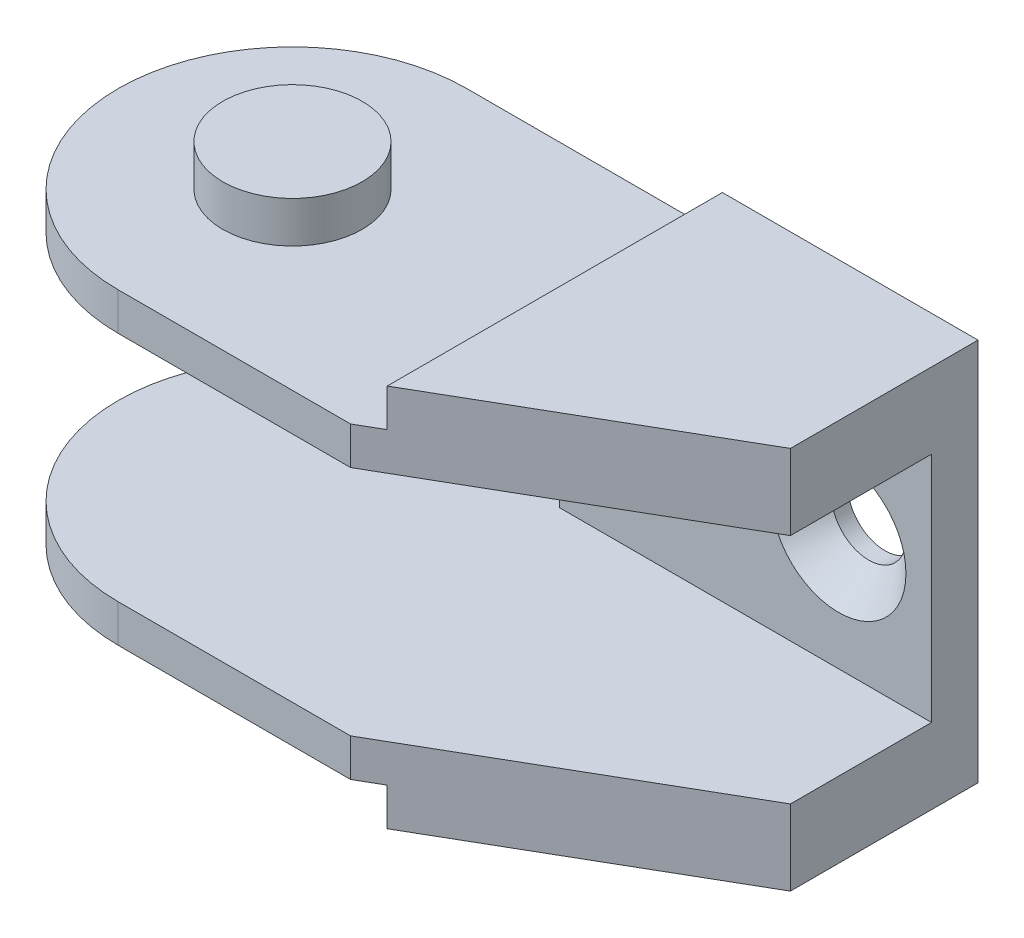
ISO-10303-21;
HEADER;
FILE_DESCRIPTION(('STEP AP214'),'2;1');
FILE_NAME('part.step','',(''),(''),'','','');
FILE_SCHEMA(('AUTOMOTIVE_DESIGN { 1 0 10303 214 1 1 1 1 }'));
ENDSEC;
DATA;
#1=APPLICATION_CONTEXT('core data for automotive mechanical design processes');
#2=APPLICATION_PROTOCOL_DEFINITION('international standard','automotive_design',2000,#1);
#3=PRODUCT_CONTEXT('',#1,'mechanical');
#4=PRODUCT('Part','Part','',(#3));
#5=PRODUCT_RELATED_PRODUCT_CATEGORY('part','',(#4));
#6=PRODUCT_DEFINITION_FORMATION('','',#4);
#7=PRODUCT_DEFINITION_CONTEXT('part definition',#1,'design');
#8=PRODUCT_DEFINITION('design','',#6,#7);
#9=PRODUCT_DEFINITION_SHAPE('','',#8);
#10=(LENGTH_UNIT() NAMED_UNIT(*) SI_UNIT(.MILLI.,.METRE.));
#11=(NAMED_UNIT(*) PLANE_ANGLE_UNIT() SI_UNIT($,.RADIAN.));
#12=(NAMED_UNIT(*) SI_UNIT($,.STERADIAN.) SOLID_ANGLE_UNIT());
#13=UNCERTAINTY_MEASURE_WITH_UNIT(LENGTH_MEASURE(1.E-05),#10,'distance_accuracy_value','');
#14=(GEOMETRIC_REPRESENTATION_CONTEXT(3) GLOBAL_UNCERTAINTY_ASSIGNED_CONTEXT((#13)) GLOBAL_UNIT_ASSIGNED_CONTEXT((#10,
#11,#12)) REPRESENTATION_CONTEXT('',''));
#15=CARTESIAN_POINT('',(0.,0.,0.));
#16=DIRECTION('',(0.,0.,1.));
#17=DIRECTION('',(1.,0.,0.));
#18=AXIS2_PLACEMENT_3D('',#15,#16,#17);
#19=CARTESIAN_POINT('',(0.,8.4,0.));
#20=DIRECTION('',(0.,1.,0.));
#21=DIRECTION('',(0.,0.,1.));
#22=AXIS2_PLACEMENT_3D('',#19,#20,#21);
#23=PLANE('',#22);
#24=CARTESIAN_POINT('',(0.,8.4,0.));
#25=DIRECTION('',(0.,1.,0.));
#26=DIRECTION('',(0.,0.,1.));
#27=AXIS2_PLACEMENT_3D('',#24,#25,#26);
#28=CIRCLE('',#27,3.);
#29=CARTESIAN_POINT('',(0.,8.4,3.));
#30=VERTEX_POINT('',#29);
#31=EDGE_CURVE('E19',#30,#30,#28,.F.);
#32=ORIENTED_EDGE('',*,*,#31,.F.);
#33=EDGE_LOOP('',(#32));
#34=FACE_BOUND('',#33,.T.);
#35=ADVANCED_FACE('F16',(#34),#23,.T.);
#36=CARTESIAN_POINT('',(0.,-8.4,0.));
#37=DIRECTION('',(0.,-1.,0.));
#38=DIRECTION('',(0.,0.,-1.));
#39=AXIS2_PLACEMENT_3D('',#36,#37,#38);
#40=PLANE('',#39);
#41=CARTESIAN_POINT('',(0.,-8.4,0.));
#42=DIRECTION('',(0.,1.,0.));
#43=DIRECTION('',(0.,0.,1.));
#44=AXIS2_PLACEMENT_3D('',#41,#42,#43);
#45=CIRCLE('',#44,3.);
#46=CARTESIAN_POINT('',(0.,-8.4,3.));
#47=VERTEX_POINT('',#46);
#48=EDGE_CURVE('E134',#47,#47,#45,.T.);
#49=ORIENTED_EDGE('',*,*,#48,.F.);
#50=EDGE_LOOP('',(#49));
#51=FACE_BOUND('',#50,.T.);
#52=ADVANCED_FACE('F257',(#51),#40,.T.);
#53=CARTESIAN_POINT('',(0.,7.5125,0.));
#54=DIRECTION('',(0.,1.,0.));
#55=DIRECTION('',(0.,0.,1.));
#56=AXIS2_PLACEMENT_3D('',#53,#54,#55);
#57=CYLINDRICAL_SURFACE('',#56,3.);
#58=CARTESIAN_POINT('',(0.,6.625,0.));
#59=DIRECTION('',(0.,1.,0.));
#60=DIRECTION('',(0.,0.,1.));
#61=AXIS2_PLACEMENT_3D('',#58,#59,#60);
#62=CIRCLE('',#61,3.);
#63=CARTESIAN_POINT('',(0.,6.625,3.));
#64=VERTEX_POINT('',#63);
#65=EDGE_CURVE('E169',#64,#64,#62,.F.);
#66=ORIENTED_EDGE('',*,*,#65,.F.);
#67=EDGE_LOOP('',(#66));
#68=FACE_BOUND('',#67,.T.);
#69=ORIENTED_EDGE('',*,*,#31,.T.);
#70=EDGE_LOOP('',(#69));
#71=FACE_BOUND('',#70,.T.);
#72=ADVANCED_FACE('F259',(#68,#71),#57,.T.);
#73=CARTESIAN_POINT('',(11.,7.4375,0.));
#74=DIRECTION('',(-1.,0.,0.));
#75=DIRECTION('',(0.,0.,1.));
#76=AXIS2_PLACEMENT_3D('',#73,#74,#75);
#77=PLANE('',#76);
#78=DIRECTION('',(0.,1.,0.));
#79=VECTOR('',#78,1.);
#80=CARTESIAN_POINT('',(11.,7.4375,-7.5));
#81=LINE('',#80,#79);
#82=CARTESIAN_POINT('',(11.,8.25,-7.5));
#83=VERTEX_POINT('',#82);
#84=CARTESIAN_POINT('',(11.,6.625,-7.5));
#85=VERTEX_POINT('',#84);
#86=EDGE_CURVE('E209',#83,#85,#81,.F.);
#87=ORIENTED_EDGE('',*,*,#86,.T.);
#88=DIRECTION('',(0.,0.,1.));
#89=VECTOR('',#88,1.);
#90=CARTESIAN_POINT('',(11.,6.625,0.));
#91=LINE('',#90,#89);
#92=CARTESIAN_POINT('',(11.,6.625,6.92264973081037));
#93=VERTEX_POINT('',#92);
#94=EDGE_CURVE('E166',#93,#85,#91,.F.);
#95=ORIENTED_EDGE('',*,*,#94,.F.);
#96=DIRECTION('',(0.,1.,0.));
#97=VECTOR('',#96,1.);
#98=CARTESIAN_POINT('',(11.,7.4375,6.92264973081037));
#99=LINE('',#98,#97);
#100=CARTESIAN_POINT('',(11.,8.25,6.92264973081037));
#101=VERTEX_POINT('',#100);
#102=EDGE_CURVE('E210',#93,#101,#99,.T.);
#103=ORIENTED_EDGE('',*,*,#102,.T.);
#104=DIRECTION('',(0.,0.,-1.));
#105=VECTOR('',#104,1.);
#106=CARTESIAN_POINT('',(11.,8.25,-0.800598234334194));
#107=LINE('',#106,#105);
#108=EDGE_CURVE('E220',#101,#83,#107,.T.);
#109=ORIENTED_EDGE('',*,*,#108,.T.);
#110=EDGE_LOOP('',(#87,#95,#103,#109));
#111=FACE_BOUND('',#110,.T.);
#112=ADVANCED_FACE('F265',(#111),#77,.T.);
#113=CARTESIAN_POINT('',(11.,-7.4375,0.));
#114=DIRECTION('',(-1.,0.,0.));
#115=DIRECTION('',(0.,0.,1.));
#116=AXIS2_PLACEMENT_3D('',#113,#114,#115);
#117=PLANE('',#116);
#118=DIRECTION('',(0.,1.,0.));
#119=VECTOR('',#118,1.);
#120=CARTESIAN_POINT('',(11.,-7.4375,-7.5));
#121=LINE('',#120,#119);
#122=CARTESIAN_POINT('',(11.,-6.625,-7.5));
#123=VERTEX_POINT('',#122);
#124=CARTESIAN_POINT('',(11.,-8.25,-7.5));
#125=VERTEX_POINT('',#124);
#126=EDGE_CURVE('E207',#123,#125,#121,.F.);
#127=ORIENTED_EDGE('',*,*,#126,.T.);
#128=DIRECTION('',(0.,0.,-1.));
#129=VECTOR('',#128,1.);
#130=CARTESIAN_POINT('',(11.,-8.25,-0.800598234334194));
#131=LINE('',#130,#129);
#132=CARTESIAN_POINT('',(11.,-8.25,6.92264973081037));
#133=VERTEX_POINT('',#132);
#134=EDGE_CURVE('E217',#133,#125,#131,.T.);
#135=ORIENTED_EDGE('',*,*,#134,.F.);
#136=DIRECTION('',(0.,1.,0.));
#137=VECTOR('',#136,1.);
#138=CARTESIAN_POINT('',(11.,-8.25,6.92264973081037));
#139=LINE('',#138,#137);
#140=CARTESIAN_POINT('',(11.,-6.625,6.92264973081037));
#141=VERTEX_POINT('',#140);
#142=EDGE_CURVE('E196',#141,#133,#139,.F.);
#143=ORIENTED_EDGE('',*,*,#142,.F.);
#144=DIRECTION('',(0.,0.,-1.));
#145=VECTOR('',#144,1.);
#146=CARTESIAN_POINT('',(11.,-6.625,0.));
#147=LINE('',#146,#145);
#148=EDGE_CURVE('E150',#123,#141,#147,.F.);
#149=ORIENTED_EDGE('',*,*,#148,.F.);
#150=EDGE_LOOP('',(#127,#135,#143,#149));
#151=FACE_BOUND('',#150,.T.);
#152=ADVANCED_FACE('F349',(#151),#117,.T.);
#153=CARTESIAN_POINT('',(0.,-7.5125,0.));
#154=DIRECTION('',(0.,1.,0.));
#155=DIRECTION('',(0.,0.,1.));
#156=AXIS2_PLACEMENT_3D('',#153,#154,#155);
#157=CYLINDRICAL_SURFACE('',#156,3.);
#158=CARTESIAN_POINT('',(0.,-6.625,0.));
#159=DIRECTION('',(0.,1.,0.));
#160=DIRECTION('',(0.,0.,1.));
#161=AXIS2_PLACEMENT_3D('',#158,#159,#160);
#162=CIRCLE('',#161,3.);
#163=CARTESIAN_POINT('',(0.,-6.625,3.));
#164=VERTEX_POINT('',#163);
#165=EDGE_CURVE('E143',#164,#164,#162,.T.);
#166=ORIENTED_EDGE('',*,*,#165,.F.);
#167=EDGE_LOOP('',(#166));
#168=FACE_BOUND('',#167,.T.);
#169=ORIENTED_EDGE('',*,*,#48,.T.);
#170=EDGE_LOOP('',(#169));
#171=FACE_BOUND('',#170,.T.);
#172=ADVANCED_FACE('F255',(#168,#171),#157,.T.);
#173=CARTESIAN_POINT('',(10.,-8.25,7.5));
#174=DIRECTION('',(0.,0.,1.));
#175=DIRECTION('',(1.,0.,0.));
#176=AXIS2_PLACEMENT_3D('',#173,#174,#175);
#177=PLANE('',#176);
#178=DIRECTION('',(1.,0.,0.));
#179=VECTOR('',#178,1.);
#180=CARTESIAN_POINT('',(1.75,-5.,7.5));
#181=LINE('',#180,#179);
#182=CARTESIAN_POINT('',(10.,-5.,7.5));
#183=VERTEX_POINT('',#182);
#184=CARTESIAN_POINT('',(0.,-5.,7.5));
#185=VERTEX_POINT('',#184);
#186=EDGE_CURVE('E129',#183,#185,#181,.F.);
#187=ORIENTED_EDGE('',*,*,#186,.T.);
#188=DIRECTION('',(0.,-1.,0.));
#189=VECTOR('',#188,1.);
#190=CARTESIAN_POINT('',(0.,-8.25,7.5));
#191=LINE('',#190,#189);
#192=CARTESIAN_POINT('',(0.,-6.625,7.5));
#193=VERTEX_POINT('',#192);
#194=EDGE_CURVE('E122',#193,#185,#191,.F.);
#195=ORIENTED_EDGE('',*,*,#194,.F.);
#196=DIRECTION('',(1.,0.,0.));
#197=VECTOR('',#196,1.);
#198=CARTESIAN_POINT('',(-4.75,-6.625,7.5));
#199=LINE('',#198,#197);
#200=CARTESIAN_POINT('',(10.,-6.625,7.5));
#201=VERTEX_POINT('',#200);
#202=EDGE_CURVE('E126',#201,#193,#199,.F.);
#203=ORIENTED_EDGE('',*,*,#202,.F.);
#204=DIRECTION('',(0.,1.,0.));
#205=VECTOR('',#204,1.);
#206=CARTESIAN_POINT('',(10.,-8.25,7.5));
#207=LINE('',#206,#205);
#208=EDGE_CURVE('E200',#183,#201,#207,.F.);
#209=ORIENTED_EDGE('',*,*,#208,.F.);
#210=EDGE_LOOP('',(#187,#195,#203,#209));
#211=FACE_BOUND('',#210,.T.);
#212=ADVANCED_FACE('F124',(#211),#177,.T.);
#213=CARTESIAN_POINT('',(0.,-8.25,0.));
#214=DIRECTION('',(0.,-1.,0.));
#215=DIRECTION('',(0.,0.,-1.));
#216=AXIS2_PLACEMENT_3D('',#213,#214,#215);
#217=CYLINDRICAL_SURFACE('',#216,7.5);
#218=CARTESIAN_POINT('',(0.,-5.,0.));
#219=DIRECTION('',(0.,-1.,0.));
#220=DIRECTION('',(0.,0.,-1.));
#221=AXIS2_PLACEMENT_3D('',#218,#219,#220);
#222=CIRCLE('',#221,7.5);
#223=CARTESIAN_POINT('',(0.,-5.,-7.5));
#224=VERTEX_POINT('',#223);
#225=EDGE_CURVE('E247',#185,#224,#222,.T.);
#226=ORIENTED_EDGE('',*,*,#225,.T.);
#227=DIRECTION('',(0.,-1.,0.));
#228=VECTOR('',#227,1.);
#229=CARTESIAN_POINT('',(0.,-8.25,-7.5));
#230=LINE('',#229,#228);
#231=CARTESIAN_POINT('',(0.,-6.625,-7.5));
#232=VERTEX_POINT('',#231);
#233=EDGE_CURVE('E133',#224,#232,#230,.T.);
#234=ORIENTED_EDGE('',*,*,#233,.T.);
#235=CARTESIAN_POINT('',(0.,-6.625,0.));
#236=DIRECTION('',(0.,-1.,0.));
#237=DIRECTION('',(0.,0.,-1.));
#238=AXIS2_PLACEMENT_3D('',#235,#236,#237);
#239=CIRCLE('',#238,7.5);
#240=EDGE_CURVE('E138',#193,#232,#239,.T.);
#241=ORIENTED_EDGE('',*,*,#240,.F.);
#242=ORIENTED_EDGE('',*,*,#194,.T.);
#243=EDGE_LOOP('',(#226,#234,#241,#242));
#244=FACE_BOUND('',#243,.T.);
#245=ADVANCED_FACE('F139',(#244),#217,.T.);
#246=CARTESIAN_POINT('',(10.,0.,-5.50000000004047));
#247=DIRECTION('',(0.,0.,1.));
#248=DIRECTION('',(1.,0.,0.));
#249=AXIS2_PLACEMENT_3D('',#246,#247,#248);
#250=CONICAL_SURFACE('',#249,2.89999999988822,0.785398163419311);
#251=CARTESIAN_POINT('',(10.,0.,-5.49999999997453));
#252=DIRECTION('',(0.,0.,1.));
#253=DIRECTION('',(1.,0.,0.));
#254=AXIS2_PLACEMENT_3D('',#251,#252,#253);
#255=CIRCLE('',#254,2.89999999995416);
#256=CARTESIAN_POINT('',(12.8999999999542,0.,-5.49999999997453));
#257=VERTEX_POINT('',#256);
#258=EDGE_CURVE('E243',#257,#257,#255,.F.);
#259=ORIENTED_EDGE('',*,*,#258,.F.);
#260=EDGE_LOOP('',(#259));
#261=FACE_BOUND('',#260,.T.);
#262=CARTESIAN_POINT('',(10.,0.,-6.8));
#263=DIRECTION('',(0.,0.,-1.));
#264=DIRECTION('',(-1.,0.,0.));
#265=AXIS2_PLACEMENT_3D('',#262,#263,#264);
#266=CIRCLE('',#265,1.6);
#267=CARTESIAN_POINT('',(8.4,0.,-6.8));
#268=VERTEX_POINT('',#267);
#269=EDGE_CURVE('E170',#268,#268,#266,.T.);
#270=ORIENTED_EDGE('',*,*,#269,.T.);
#271=EDGE_LOOP('',(#270));
#272=FACE_BOUND('',#271,.T.);
#273=ADVANCED_FACE('F338',(#261,#272),#250,.F.);
#274=CARTESIAN_POINT('',(18.,0.,-5.49999999992679));
#275=DIRECTION('',(0.,0.,1.));
#276=DIRECTION('',(1.,0.,0.));
#277=AXIS2_PLACEMENT_3D('',#274,#275,#276);
#278=CONICAL_SURFACE('',#277,2.89999999998326,0.785398163419311);
#279=CARTESIAN_POINT('',(18.,0.,-5.49999999995589));
#280=DIRECTION('',(0.,0.,1.));
#281=DIRECTION('',(1.,0.,0.));
#282=AXIS2_PLACEMENT_3D('',#279,#280,#281);
#283=CIRCLE('',#282,2.89999999995416);
#284=CARTESIAN_POINT('',(20.8999999999542,0.,-5.49999999995589));
#285=VERTEX_POINT('',#284);
#286=EDGE_CURVE('E240',#285,#285,#283,.F.);
#287=ORIENTED_EDGE('',*,*,#286,.F.);
#288=EDGE_LOOP('',(#287));
#289=FACE_BOUND('',#288,.T.);
#290=CARTESIAN_POINT('',(18.,0.,-6.8));
#291=DIRECTION('',(0.,0.,-1.));
#292=DIRECTION('',(-1.,0.,0.));
#293=AXIS2_PLACEMENT_3D('',#290,#291,#292);
#294=CIRCLE('',#293,1.6);
#295=CARTESIAN_POINT('',(16.4,0.,-6.8));
#296=VERTEX_POINT('',#295);
#297=EDGE_CURVE('E202',#296,#296,#294,.T.);
#298=ORIENTED_EDGE('',*,*,#297,.T.);
#299=EDGE_LOOP('',(#298));
#300=FACE_BOUND('',#299,.T.);
#301=ADVANCED_FACE('F334',(#289,#300),#278,.F.);
#302=CARTESIAN_POINT('',(22.,-8.25,0.571796769724493));
#303=DIRECTION('',(0.5,0.,0.866025403784439));
#304=DIRECTION('',(0.866025403784439,0.,-0.5));
#305=AXIS2_PLACEMENT_3D('',#302,#303,#304);
#306=PLANE('',#305);
#307=DIRECTION('',(-0.866025403784439,0.,0.5));
#308=VECTOR('',#307,1.);
#309=CARTESIAN_POINT('',(22.,-5.,0.571796769724493));
#310=LINE('',#309,#308);
#311=CARTESIAN_POINT('',(22.,-5.,0.571796769724493));
#312=VERTEX_POINT('',#311);
#313=EDGE_CURVE('E197',#312,#183,#310,.T.);
#314=ORIENTED_EDGE('',*,*,#313,.T.);
#315=ORIENTED_EDGE('',*,*,#208,.T.);
#316=DIRECTION('',(-0.866025403784437,0.,0.500000000000002));
#317=VECTOR('',#316,1.);
#318=CARTESIAN_POINT('',(11.,-6.625,6.92264973081037));
#319=LINE('',#318,#317);
#320=EDGE_CURVE('E148',#141,#201,#319,.T.);
#321=ORIENTED_EDGE('',*,*,#320,.F.);
#322=ORIENTED_EDGE('',*,*,#142,.T.);
#323=DIRECTION('',(-0.866025403784439,0.,0.5));
#324=VECTOR('',#323,1.);
#325=CARTESIAN_POINT('',(22.,-8.25,0.571796769724493));
#326=LINE('',#325,#324);
#327=CARTESIAN_POINT('',(22.,-8.25,0.571796769724493));
#328=VERTEX_POINT('',#327);
#329=EDGE_CURVE('E160',#328,#133,#326,.T.);
#330=ORIENTED_EDGE('',*,*,#329,.F.);
#331=DIRECTION('',(0.,1.,0.));
#332=VECTOR('',#331,1.);
#333=CARTESIAN_POINT('',(22.,-8.25,0.571796769724494));
#334=LINE('',#333,#332);
#335=EDGE_CURVE('E192',#312,#328,#334,.F.);
#336=ORIENTED_EDGE('',*,*,#335,.F.);
#337=EDGE_LOOP('',(#314,#315,#321,#322,#330,#336));
#338=FACE_BOUND('',#337,.T.);
#339=ADVANCED_FACE('F330',(#338),#306,.T.);
#340=CARTESIAN_POINT('',(18.,0.,-7.15));
#341=DIRECTION('',(0.,0.,-1.));
#342=DIRECTION('',(-1.,0.,0.));
#343=AXIS2_PLACEMENT_3D('',#340,#341,#342);
#344=CYLINDRICAL_SURFACE('',#343,1.6);
#345=CARTESIAN_POINT('',(18.,0.,-7.5));
#346=DIRECTION('',(0.,0.,-1.));
#347=DIRECTION('',(-1.,0.,0.));
#348=AXIS2_PLACEMENT_3D('',#345,#346,#347);
#349=CIRCLE('',#348,1.6);
#350=CARTESIAN_POINT('',(16.4,0.,-7.5));
#351=VERTEX_POINT('',#350);
#352=EDGE_CURVE('E234',#351,#351,#349,.F.);
#353=ORIENTED_EDGE('',*,*,#352,.F.);
#354=EDGE_LOOP('',(#353));
#355=FACE_BOUND('',#354,.T.);
#356=ORIENTED_EDGE('',*,*,#297,.F.);
#357=EDGE_LOOP('',(#356));
#358=FACE_BOUND('',#357,.T.);
#359=ADVANCED_FACE('F326',(#355,#358),#344,.F.);
#360=CARTESIAN_POINT('',(10.,0.,-7.15));
#361=DIRECTION('',(0.,0.,-1.));
#362=DIRECTION('',(-1.,0.,0.));
#363=AXIS2_PLACEMENT_3D('',#360,#361,#362);
#364=CYLINDRICAL_SURFACE('',#363,1.6);
#365=CARTESIAN_POINT('',(10.,0.,-7.5));
#366=DIRECTION('',(0.,0.,-1.));
#367=DIRECTION('',(-1.,0.,0.));
#368=AXIS2_PLACEMENT_3D('',#365,#366,#367);
#369=CIRCLE('',#368,1.6);
#370=CARTESIAN_POINT('',(8.4,0.,-7.5));
#371=VERTEX_POINT('',#370);
#372=EDGE_CURVE('E231',#371,#371,#369,.F.);
#373=ORIENTED_EDGE('',*,*,#372,.F.);
#374=EDGE_LOOP('',(#373));
#375=FACE_BOUND('',#374,.T.);
#376=ORIENTED_EDGE('',*,*,#269,.F.);
#377=EDGE_LOOP('',(#376));
#378=FACE_BOUND('',#377,.T.);
#379=ADVANCED_FACE('F322',(#375,#378),#364,.F.);
#380=CARTESIAN_POINT('',(-4.75,6.625,0.));
#381=DIRECTION('',(0.,1.,0.));
#382=DIRECTION('',(0.,0.,1.));
#383=AXIS2_PLACEMENT_3D('',#380,#381,#382);
#384=PLANE('',#383);
#385=ORIENTED_EDGE('',*,*,#65,.T.);
#386=EDGE_LOOP('',(#385));
#387=FACE_BOUND('',#386,.T.);
#388=DIRECTION('',(0.866025403784439,0.,-0.5));
#389=VECTOR('',#388,1.);
#390=CARTESIAN_POINT('',(22.,6.62500000000001,0.571796769724493));
#391=LINE('',#390,#389);
#392=CARTESIAN_POINT('',(10.,6.625,7.5));
#393=VERTEX_POINT('',#392);
#394=EDGE_CURVE('E176',#93,#393,#391,.F.);
#395=ORIENTED_EDGE('',*,*,#394,.F.);
#396=ORIENTED_EDGE('',*,*,#94,.T.);
#397=DIRECTION('',(-1.,0.,0.));
#398=VECTOR('',#397,1.);
#399=CARTESIAN_POINT('',(0.,6.625,-7.5));
#400=LINE('',#399,#398);
#401=CARTESIAN_POINT('',(0.,6.625,-7.5));
#402=VERTEX_POINT('',#401);
#403=EDGE_CURVE('E161',#402,#85,#400,.F.);
#404=ORIENTED_EDGE('',*,*,#403,.F.);
#405=CARTESIAN_POINT('',(0.,6.625,0.));
#406=DIRECTION('',(0.,-1.,0.));
#407=DIRECTION('',(0.,0.,-1.));
#408=AXIS2_PLACEMENT_3D('',#405,#406,#407);
#409=CIRCLE('',#408,7.5);
#410=CARTESIAN_POINT('',(0.,6.625,7.5));
#411=VERTEX_POINT('',#410);
#412=EDGE_CURVE('E238',#411,#402,#409,.T.);
#413=ORIENTED_EDGE('',*,*,#412,.F.);
#414=DIRECTION('',(1.,0.,0.));
#415=VECTOR('',#414,1.);
#416=CARTESIAN_POINT('',(10.,6.625,7.5));
#417=LINE('',#416,#415);
#418=EDGE_CURVE('E171',#393,#411,#417,.F.);
#419=ORIENTED_EDGE('',*,*,#418,.F.);
#420=EDGE_LOOP('',(#395,#396,#404,#413,#419));
#421=FACE_BOUND('',#420,.T.);
#422=ADVANCED_FACE('F318',(#387,#421),#384,.T.);
#423=CARTESIAN_POINT('',(7.61195926998478,8.25,-0.800598234334194));
#424=DIRECTION('',(0.,-1.,0.));
#425=DIRECTION('',(0.,0.,-1.));
#426=AXIS2_PLACEMENT_3D('',#423,#424,#425);
#427=PLANE('',#426);
#428=DIRECTION('',(0.866025403784439,0.,-0.5));
#429=VECTOR('',#428,1.);
#430=CARTESIAN_POINT('',(22.,8.25000000000001,0.571796769724493));
#431=LINE('',#430,#429);
#432=CARTESIAN_POINT('',(22.,8.25000000000001,0.571796769724493));
#433=VERTEX_POINT('',#432);
#434=EDGE_CURVE('E175',#433,#101,#431,.F.);
#435=ORIENTED_EDGE('',*,*,#434,.F.);
#436=DIRECTION('',(0.,0.,-1.));
#437=VECTOR('',#436,1.);
#438=CARTESIAN_POINT('',(22.,8.25,-7.5));
#439=LINE('',#438,#437);
#440=CARTESIAN_POINT('',(22.,8.25,-7.5));
#441=VERTEX_POINT('',#440);
#442=EDGE_CURVE('E180',#441,#433,#439,.F.);
#443=ORIENTED_EDGE('',*,*,#442,.F.);
#444=DIRECTION('',(-1.,0.,0.));
#445=VECTOR('',#444,1.);
#446=CARTESIAN_POINT('',(0.,8.25,-7.5));
#447=LINE('',#446,#445);
#448=EDGE_CURVE('E164',#83,#441,#447,.F.);
#449=ORIENTED_EDGE('',*,*,#448,.F.);
#450=ORIENTED_EDGE('',*,*,#108,.F.);
#451=EDGE_LOOP('',(#435,#443,#449,#450));
#452=FACE_BOUND('',#451,.T.);
#453=ADVANCED_FACE('F314',(#452),#427,.F.);
#454=CARTESIAN_POINT('',(7.61195926998478,-8.25,-0.800598234334194));
#455=DIRECTION('',(0.,-1.,0.));
#456=DIRECTION('',(0.,0.,-1.));
#457=AXIS2_PLACEMENT_3D('',#454,#455,#456);
#458=PLANE('',#457);
#459=DIRECTION('',(0.,0.,-1.));
#460=VECTOR('',#459,1.);
#461=CARTESIAN_POINT('',(22.,-8.25,-7.5));
#462=LINE('',#461,#460);
#463=CARTESIAN_POINT('',(22.,-8.25,-7.5));
#464=VERTEX_POINT('',#463);
#465=EDGE_CURVE('E182',#328,#464,#462,.T.);
#466=ORIENTED_EDGE('',*,*,#465,.F.);
#467=ORIENTED_EDGE('',*,*,#329,.T.);
#468=ORIENTED_EDGE('',*,*,#134,.T.);
#469=DIRECTION('',(-1.,0.,0.));
#470=VECTOR('',#469,1.);
#471=CARTESIAN_POINT('',(0.,-8.25,-7.5));
#472=LINE('',#471,#470);
#473=EDGE_CURVE('E158',#464,#125,#472,.T.);
#474=ORIENTED_EDGE('',*,*,#473,.F.);
#475=EDGE_LOOP('',(#466,#467,#468,#474));
#476=FACE_BOUND('',#475,.T.);
#477=ADVANCED_FACE('F310',(#476),#458,.T.);
#478=CARTESIAN_POINT('',(-4.75,-6.625,0.));
#479=DIRECTION('',(0.,-1.,0.));
#480=DIRECTION('',(0.,0.,-1.));
#481=AXIS2_PLACEMENT_3D('',#478,#479,#480);
#482=PLANE('',#481);
#483=ORIENTED_EDGE('',*,*,#165,.T.);
#484=EDGE_LOOP('',(#483));
#485=FACE_BOUND('',#484,.T.);
#486=ORIENTED_EDGE('',*,*,#240,.T.);
#487=DIRECTION('',(-1.,0.,0.));
#488=VECTOR('',#487,1.);
#489=CARTESIAN_POINT('',(0.,-6.625,-7.5));
#490=LINE('',#489,#488);
#491=EDGE_CURVE('E156',#123,#232,#490,.T.);
#492=ORIENTED_EDGE('',*,*,#491,.F.);
#493=ORIENTED_EDGE('',*,*,#148,.T.);
#494=ORIENTED_EDGE('',*,*,#320,.T.);
#495=ORIENTED_EDGE('',*,*,#202,.T.);
#496=EDGE_LOOP('',(#486,#492,#493,#494,#495));
#497=FACE_BOUND('',#496,.T.);
#498=ADVANCED_FACE('F145',(#485,#497),#482,.T.);
#499=CARTESIAN_POINT('',(1.75,-5.,0.));
#500=DIRECTION('',(0.,-1.,0.));
#501=DIRECTION('',(0.,0.,-1.));
#502=AXIS2_PLACEMENT_3D('',#499,#500,#501);
#503=PLANE('',#502);
#504=DIRECTION('',(0.,0.,1.));
#505=VECTOR('',#504,1.);
#506=CARTESIAN_POINT('',(6.,-5.,-5.5));
#507=LINE('',#506,#505);
#508=CARTESIAN_POINT('',(6.,-5.,-7.5));
#509=VERTEX_POINT('',#508);
#510=CARTESIAN_POINT('',(6.,-5.,-5.5));
#511=VERTEX_POINT('',#510);
#512=EDGE_CURVE('E372',#509,#511,#507,.T.);
#513=ORIENTED_EDGE('',*,*,#512,.F.);
#514=DIRECTION('',(-1.,0.,0.));
#515=VECTOR('',#514,1.);
#516=CARTESIAN_POINT('',(0.,-5.,-7.5));
#517=LINE('',#516,#515);
#518=EDGE_CURVE('E154',#224,#509,#517,.F.);
#519=ORIENTED_EDGE('',*,*,#518,.F.);
#520=ORIENTED_EDGE('',*,*,#225,.F.);
#521=ORIENTED_EDGE('',*,*,#186,.F.);
#522=ORIENTED_EDGE('',*,*,#313,.F.);
#523=DIRECTION('',(0.,0.,-1.));
#524=VECTOR('',#523,1.);
#525=CARTESIAN_POINT('',(22.,-5.,-7.5));
#526=LINE('',#525,#524);
#527=CARTESIAN_POINT('',(22.,-5.,-5.5));
#528=VERTEX_POINT('',#527);
#529=EDGE_CURVE('E190',#528,#312,#526,.F.);
#530=ORIENTED_EDGE('',*,*,#529,.F.);
#531=DIRECTION('',(1.,0.,0.));
#532=VECTOR('',#531,1.);
#533=CARTESIAN_POINT('',(22.,-5.,-5.5));
#534=LINE('',#533,#532);
#535=EDGE_CURVE('E246',#511,#528,#534,.T.);
#536=ORIENTED_EDGE('',*,*,#535,.F.);
#537=EDGE_LOOP('',(#513,#519,#520,#521,#522,#530,#536));
#538=FACE_BOUND('',#537,.T.);
#539=ADVANCED_FACE('F303',(#538),#503,.F.);
#540=CARTESIAN_POINT('',(22.,-6.625,-5.5));
#541=DIRECTION('',(0.,0.,1.));
#542=DIRECTION('',(1.,0.,0.));
#543=AXIS2_PLACEMENT_3D('',#540,#541,#542);
#544=PLANE('',#543);
#545=ORIENTED_EDGE('',*,*,#286,.T.);
#546=EDGE_LOOP('',(#545));
#547=FACE_BOUND('',#546,.T.);
#548=ORIENTED_EDGE('',*,*,#258,.T.);
#549=EDGE_LOOP('',(#548));
#550=FACE_BOUND('',#549,.T.);
#551=ORIENTED_EDGE('',*,*,#535,.T.);
#552=DIRECTION('',(0.,1.,0.));
#553=VECTOR('',#552,1.);
#554=CARTESIAN_POINT('',(22.,-8.25,-5.5));
#555=LINE('',#554,#553);
#556=CARTESIAN_POINT('',(22.,5.,-5.5));
#557=VERTEX_POINT('',#556);
#558=EDGE_CURVE('E193',#557,#528,#555,.F.);
#559=ORIENTED_EDGE('',*,*,#558,.F.);
#560=DIRECTION('',(1.,0.,0.));
#561=VECTOR('',#560,1.);
#562=CARTESIAN_POINT('',(1.75,5.,-5.5));
#563=LINE('',#562,#561);
#564=CARTESIAN_POINT('',(6.,5.,-5.5));
#565=VERTEX_POINT('',#564);
#566=EDGE_CURVE('E385',#565,#557,#563,.T.);
#567=ORIENTED_EDGE('',*,*,#566,.F.);
#568=DIRECTION('',(0.,1.,0.));
#569=VECTOR('',#568,1.);
#570=CARTESIAN_POINT('',(6.,-6.625,-5.5));
#571=LINE('',#570,#569);
#572=EDGE_CURVE('E392',#511,#565,#571,.T.);
#573=ORIENTED_EDGE('',*,*,#572,.F.);
#574=EDGE_LOOP('',(#551,#559,#567,#573));
#575=FACE_BOUND('',#574,.T.);
#576=ADVANCED_FACE('F299',(#547,#550,#575),#544,.T.);
#577=CARTESIAN_POINT('',(22.,-8.25,-7.5));
#578=DIRECTION('',(1.,0.,0.));
#579=DIRECTION('',(0.,0.,-1.));
#580=AXIS2_PLACEMENT_3D('',#577,#578,#579);
#581=PLANE('',#580);
#582=ORIENTED_EDGE('',*,*,#442,.T.);
#583=DIRECTION('',(0.,1.,0.));
#584=VECTOR('',#583,1.);
#585=CARTESIAN_POINT('',(22.,-8.25,0.571796769724493));
#586=LINE('',#585,#584);
#587=CARTESIAN_POINT('',(22.,5.,0.571796769724493));
#588=VERTEX_POINT('',#587);
#589=EDGE_CURVE('E179',#588,#433,#586,.T.);
#590=ORIENTED_EDGE('',*,*,#589,.F.);
#591=DIRECTION('',(0.,0.,-1.));
#592=VECTOR('',#591,1.);
#593=CARTESIAN_POINT('',(22.,5.,0.));
#594=LINE('',#593,#592);
#595=EDGE_CURVE('E380',#557,#588,#594,.F.);
#596=ORIENTED_EDGE('',*,*,#595,.F.);
#597=ORIENTED_EDGE('',*,*,#558,.T.);
#598=ORIENTED_EDGE('',*,*,#529,.T.);
#599=ORIENTED_EDGE('',*,*,#335,.T.);
#600=ORIENTED_EDGE('',*,*,#465,.T.);
#601=DIRECTION('',(0.,1.,0.));
#602=VECTOR('',#601,1.);
#603=CARTESIAN_POINT('',(22.,-8.25,-7.5));
#604=LINE('',#603,#602);
#605=EDGE_CURVE('E185',#441,#464,#604,.F.);
#606=ORIENTED_EDGE('',*,*,#605,.F.);
#607=EDGE_LOOP('',(#582,#590,#596,#597,#598,#599,#600,#606));
#608=FACE_BOUND('',#607,.T.);
#609=ADVANCED_FACE('F295',(#608),#581,.T.);
#610=CARTESIAN_POINT('',(22.,-8.25,0.571796769724493));
#611=DIRECTION('',(0.5,0.,0.866025403784439));
#612=DIRECTION('',(0.866025403784439,0.,-0.5));
#613=AXIS2_PLACEMENT_3D('',#610,#611,#612);
#614=PLANE('',#613);
#615=ORIENTED_EDGE('',*,*,#434,.T.);
#616=ORIENTED_EDGE('',*,*,#102,.F.);
#617=ORIENTED_EDGE('',*,*,#394,.T.);
#618=DIRECTION('',(0.,1.,0.));
#619=VECTOR('',#618,1.);
#620=CARTESIAN_POINT('',(10.,-8.25,7.5));
#621=LINE('',#620,#619);
#622=CARTESIAN_POINT('',(10.,5.,7.5));
#623=VERTEX_POINT('',#622);
#624=EDGE_CURVE('E174',#623,#393,#621,.T.);
#625=ORIENTED_EDGE('',*,*,#624,.F.);
#626=DIRECTION('',(-0.866025403784439,0.,0.5));
#627=VECTOR('',#626,1.);
#628=CARTESIAN_POINT('',(22.,5.,0.571796769724493));
#629=LINE('',#628,#627);
#630=EDGE_CURVE('E377',#588,#623,#629,.T.);
#631=ORIENTED_EDGE('',*,*,#630,.F.);
#632=ORIENTED_EDGE('',*,*,#589,.T.);
#633=EDGE_LOOP('',(#615,#616,#617,#625,#631,#632));
#634=FACE_BOUND('',#633,.T.);
#635=ADVANCED_FACE('F291',(#634),#614,.T.);
#636=CARTESIAN_POINT('',(10.,-8.25,7.5));
#637=DIRECTION('',(0.,0.,1.));
#638=DIRECTION('',(1.,0.,0.));
#639=AXIS2_PLACEMENT_3D('',#636,#637,#638);
#640=PLANE('',#639);
#641=DIRECTION('',(1.,0.,0.));
#642=VECTOR('',#641,1.);
#643=CARTESIAN_POINT('',(1.75,5.,7.5));
#644=LINE('',#643,#642);
#645=CARTESIAN_POINT('',(0.,5.,7.5));
#646=VERTEX_POINT('',#645);
#647=EDGE_CURVE('E230',#623,#646,#644,.F.);
#648=ORIENTED_EDGE('',*,*,#647,.F.);
#649=ORIENTED_EDGE('',*,*,#624,.T.);
#650=ORIENTED_EDGE('',*,*,#418,.T.);
#651=DIRECTION('',(0.,-1.,0.));
#652=VECTOR('',#651,1.);
#653=CARTESIAN_POINT('',(0.,-8.25,7.5));
#654=LINE('',#653,#652);
#655=EDGE_CURVE('E237',#646,#411,#654,.F.);
#656=ORIENTED_EDGE('',*,*,#655,.F.);
#657=EDGE_LOOP('',(#648,#649,#650,#656));
#658=FACE_BOUND('',#657,.T.);
#659=ADVANCED_FACE('F287',(#658),#640,.T.);
#660=CARTESIAN_POINT('',(0.,-8.25,0.));
#661=DIRECTION('',(0.,-1.,0.));
#662=DIRECTION('',(0.,0.,-1.));
#663=AXIS2_PLACEMENT_3D('',#660,#661,#662);
#664=CYLINDRICAL_SURFACE('',#663,7.5);
#665=CARTESIAN_POINT('',(0.,5.,0.));
#666=DIRECTION('',(0.,-1.,0.));
#667=DIRECTION('',(0.,0.,-1.));
#668=AXIS2_PLACEMENT_3D('',#665,#666,#667);
#669=CIRCLE('',#668,7.5);
#670=CARTESIAN_POINT('',(0.,5.,-7.5));
#671=VERTEX_POINT('',#670);
#672=EDGE_CURVE('E227',#646,#671,#669,.T.);
#673=ORIENTED_EDGE('',*,*,#672,.F.);
#674=ORIENTED_EDGE('',*,*,#655,.T.);
#675=ORIENTED_EDGE('',*,*,#412,.T.);
#676=DIRECTION('',(0.,1.,0.));
#677=VECTOR('',#676,1.);
#678=CARTESIAN_POINT('',(0.,-8.25,-7.5));
#679=LINE('',#678,#677);
#680=EDGE_CURVE('E165',#671,#402,#679,.T.);
#681=ORIENTED_EDGE('',*,*,#680,.F.);
#682=EDGE_LOOP('',(#673,#674,#675,#681));
#683=FACE_BOUND('',#682,.T.);
#684=ADVANCED_FACE('F284',(#683),#664,.T.);
#685=CARTESIAN_POINT('',(0.,-8.25,-7.5));
#686=DIRECTION('',(0.,0.,-1.));
#687=DIRECTION('',(-1.,0.,0.));
#688=AXIS2_PLACEMENT_3D('',#685,#686,#687);
#689=PLANE('',#688);
#690=ORIENTED_EDGE('',*,*,#518,.T.);
#691=DIRECTION('',(0.,1.,0.));
#692=VECTOR('',#691,1.);
#693=CARTESIAN_POINT('',(6.,-6.625,-7.5));
#694=LINE('',#693,#692);
#695=CARTESIAN_POINT('',(6.,5.,-7.5));
#696=VERTEX_POINT('',#695);
#697=EDGE_CURVE('E34',#696,#509,#694,.F.);
#698=ORIENTED_EDGE('',*,*,#697,.F.);
#699=DIRECTION('',(1.,0.,0.));
#700=VECTOR('',#699,1.);
#701=CARTESIAN_POINT('',(1.75,5.,-7.5));
#702=LINE('',#701,#700);
#703=EDGE_CURVE('E25',#671,#696,#702,.T.);
#704=ORIENTED_EDGE('',*,*,#703,.F.);
#705=ORIENTED_EDGE('',*,*,#680,.T.);
#706=ORIENTED_EDGE('',*,*,#403,.T.);
#707=ORIENTED_EDGE('',*,*,#86,.F.);
#708=ORIENTED_EDGE('',*,*,#448,.T.);
#709=ORIENTED_EDGE('',*,*,#605,.T.);
#710=ORIENTED_EDGE('',*,*,#473,.T.);
#711=ORIENTED_EDGE('',*,*,#126,.F.);
#712=ORIENTED_EDGE('',*,*,#491,.T.);
#713=ORIENTED_EDGE('',*,*,#233,.F.);
#714=EDGE_LOOP('',(#690,#698,#704,#705,#706,#707,#708,#709,#710,#711,#712,#713));
#715=FACE_BOUND('',#714,.T.);
#716=ORIENTED_EDGE('',*,*,#372,.T.);
#717=EDGE_LOOP('',(#716));
#718=FACE_BOUND('',#717,.T.);
#719=ORIENTED_EDGE('',*,*,#352,.T.);
#720=EDGE_LOOP('',(#719));
#721=FACE_BOUND('',#720,.T.);
#722=ADVANCED_FACE('F277',(#715,#718,#721),#689,.T.);
#723=CARTESIAN_POINT('',(6.,-6.625,-5.5));
#724=DIRECTION('',(-1.,0.,0.));
#725=DIRECTION('',(0.,0.,1.));
#726=AXIS2_PLACEMENT_3D('',#723,#724,#725);
#727=PLANE('',#726);
#728=ORIENTED_EDGE('',*,*,#512,.T.);
#729=ORIENTED_EDGE('',*,*,#572,.T.);
#730=DIRECTION('',(0.,0.,-1.));
#731=VECTOR('',#730,1.);
#732=CARTESIAN_POINT('',(6.,5.,0.));
#733=LINE('',#732,#731);
#734=EDGE_CURVE('E10',#696,#565,#733,.F.);
#735=ORIENTED_EDGE('',*,*,#734,.F.);
#736=ORIENTED_EDGE('',*,*,#697,.T.);
#737=EDGE_LOOP('',(#728,#729,#735,#736));
#738=FACE_BOUND('',#737,.T.);
#739=ADVANCED_FACE('F271',(#738),#727,.T.);
#740=CARTESIAN_POINT('',(1.75,5.,0.));
#741=DIRECTION('',(0.,-1.,0.));
#742=DIRECTION('',(0.,0.,-1.));
#743=AXIS2_PLACEMENT_3D('',#740,#741,#742);
#744=PLANE('',#743);
#745=ORIENTED_EDGE('',*,*,#703,.T.);
#746=ORIENTED_EDGE('',*,*,#734,.T.);
#747=ORIENTED_EDGE('',*,*,#566,.T.);
#748=ORIENTED_EDGE('',*,*,#595,.T.);
#749=ORIENTED_EDGE('',*,*,#630,.T.);
#750=ORIENTED_EDGE('',*,*,#647,.T.);
#751=ORIENTED_EDGE('',*,*,#672,.T.);
#752=EDGE_LOOP('',(#745,#746,#747,#748,#749,#750,#751));
#753=FACE_BOUND('',#752,.T.);
#754=ADVANCED_FACE('F269',(#753),#744,.T.);
#755=CLOSED_SHELL('',(#35,#52,#72,#112,#152,#172,#212,#245,#273,#301,#339,#359,#379,#422,#453,
#477,#498,#539,#576,#609,#635,#659,#684,#722,#739,#754));
#756=MANIFOLD_SOLID_BREP('B1',#755);
#757=ADVANCED_BREP_SHAPE_REPRESENTATION('',(#18,#756),#14);
#758=SHAPE_DEFINITION_REPRESENTATION(#9,#757);
ENDSEC;
END-ISO-10303-21;
